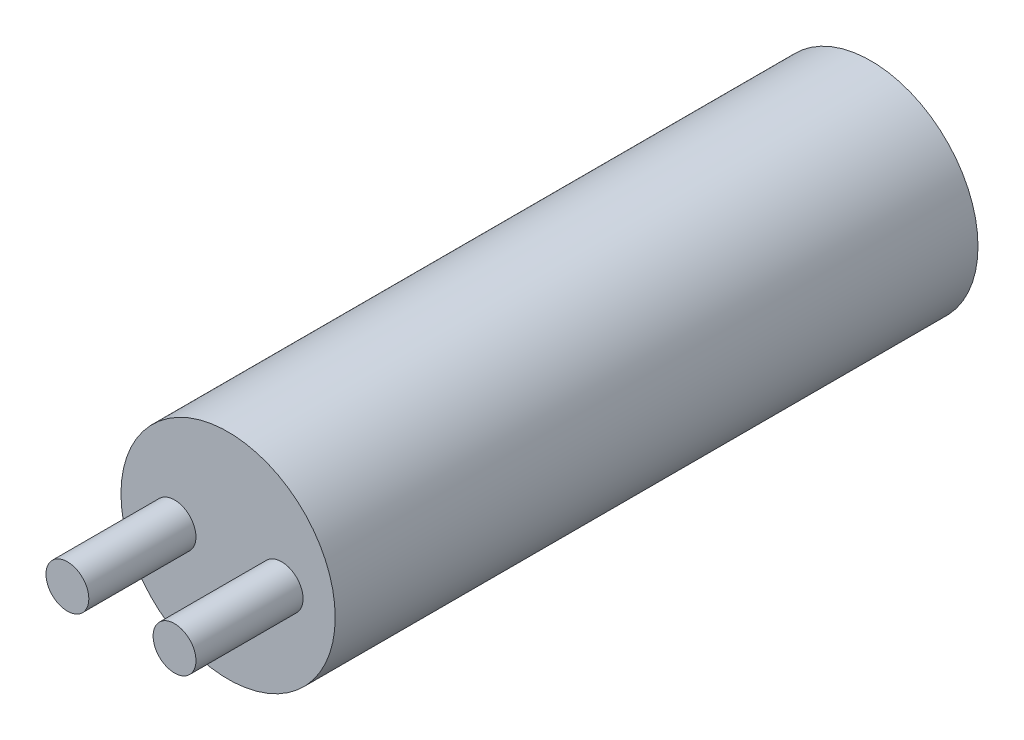
ISO-10303-21;
HEADER;
FILE_DESCRIPTION(('STEP AP214'),'2;1');
FILE_NAME('part.step','',(''),(''),'','','');
FILE_SCHEMA(('AUTOMOTIVE_DESIGN { 1 0 10303 214 1 1 1 1 }'));
ENDSEC;
DATA;
#1=APPLICATION_CONTEXT('core data for automotive mechanical design processes');
#2=APPLICATION_PROTOCOL_DEFINITION('international standard','automotive_design',2000,#1);
#3=PRODUCT_CONTEXT('',#1,'mechanical');
#4=PRODUCT('Part','Part','',(#3));
#5=PRODUCT_RELATED_PRODUCT_CATEGORY('part','',(#4));
#6=PRODUCT_DEFINITION_FORMATION('','',#4);
#7=PRODUCT_DEFINITION_CONTEXT('part definition',#1,'design');
#8=PRODUCT_DEFINITION('design','',#6,#7);
#9=PRODUCT_DEFINITION_SHAPE('','',#8);
#10=(LENGTH_UNIT() NAMED_UNIT(*) SI_UNIT(.MILLI.,.METRE.));
#11=(NAMED_UNIT(*) PLANE_ANGLE_UNIT() SI_UNIT($,.RADIAN.));
#12=(NAMED_UNIT(*) SI_UNIT($,.STERADIAN.) SOLID_ANGLE_UNIT());
#13=UNCERTAINTY_MEASURE_WITH_UNIT(LENGTH_MEASURE(1.E-05),#10,'distance_accuracy_value','');
#14=(GEOMETRIC_REPRESENTATION_CONTEXT(3) GLOBAL_UNCERTAINTY_ASSIGNED_CONTEXT((#13)) GLOBAL_UNIT_ASSIGNED_CONTEXT((#10,
#11,#12)) REPRESENTATION_CONTEXT('',''));
#15=CARTESIAN_POINT('',(0.,0.,0.));
#16=DIRECTION('',(0.,0.,1.));
#17=DIRECTION('',(1.,0.,0.));
#18=AXIS2_PLACEMENT_3D('',#15,#16,#17);
#19=CARTESIAN_POINT('',(0.,0.,101.6));
#20=DIRECTION('',(0.,0.,-1.));
#21=DIRECTION('',(-1.,0.,0.));
#22=AXIS2_PLACEMENT_3D('',#19,#20,#21);
#23=CYLINDRICAL_SURFACE('',#22,12.7);
#24=CARTESIAN_POINT('',(0.,0.,101.6));
#25=DIRECTION('',(0.,0.,1.));
#26=DIRECTION('',(1.,0.,0.));
#27=AXIS2_PLACEMENT_3D('',#24,#25,#26);
#28=CIRCLE('',#27,12.7);
#29=CARTESIAN_POINT('',(12.7,0.,101.6));
#30=VERTEX_POINT('',#29);
#31=EDGE_CURVE('E10',#30,#30,#28,.T.);
#32=ORIENTED_EDGE('',*,*,#31,.F.);
#33=EDGE_LOOP('',(#32));
#34=FACE_BOUND('',#33,.T.);
#35=CARTESIAN_POINT('',(0.,0.,25.4));
#36=DIRECTION('',(0.,0.,-1.));
#37=DIRECTION('',(-1.,0.,0.));
#38=AXIS2_PLACEMENT_3D('',#35,#36,#37);
#39=CIRCLE('',#38,12.7);
#40=CARTESIAN_POINT('',(-12.7,0.,25.4));
#41=VERTEX_POINT('',#40);
#42=EDGE_CURVE('E39',#41,#41,#39,.T.);
#43=ORIENTED_EDGE('',*,*,#42,.F.);
#44=EDGE_LOOP('',(#43));
#45=FACE_BOUND('',#44,.T.);
#46=ADVANCED_FACE('F36',(#34,#45),#23,.T.);
#47=CARTESIAN_POINT('',(0.,0.,101.6));
#48=DIRECTION('',(0.,0.,1.));
#49=DIRECTION('',(1.,0.,0.));
#50=AXIS2_PLACEMENT_3D('',#47,#48,#49);
#51=PLANE('',#50);
#52=CARTESIAN_POINT('',(6.35,0.,101.6));
#53=DIRECTION('',(0.,0.,1.));
#54=DIRECTION('',(1.,0.,0.));
#55=AXIS2_PLACEMENT_3D('',#52,#53,#54);
#56=CIRCLE('',#55,2.54);
#57=CARTESIAN_POINT('',(8.89,0.,101.6));
#58=VERTEX_POINT('',#57);
#59=EDGE_CURVE('E53',#58,#58,#56,.T.);
#60=ORIENTED_EDGE('',*,*,#59,.F.);
#61=EDGE_LOOP('',(#60));
#62=FACE_BOUND('',#61,.T.);
#63=CARTESIAN_POINT('',(-6.35,0.,101.6));
#64=DIRECTION('',(0.,0.,1.));
#65=DIRECTION('',(1.,0.,0.));
#66=AXIS2_PLACEMENT_3D('',#63,#64,#65);
#67=CIRCLE('',#66,2.54);
#68=CARTESIAN_POINT('',(-3.81,0.,101.6));
#69=VERTEX_POINT('',#68);
#70=EDGE_CURVE('E47',#69,#69,#67,.T.);
#71=ORIENTED_EDGE('',*,*,#70,.F.);
#72=EDGE_LOOP('',(#71));
#73=FACE_BOUND('',#72,.T.);
#74=ORIENTED_EDGE('',*,*,#31,.T.);
#75=EDGE_LOOP('',(#74));
#76=FACE_BOUND('',#75,.T.);
#77=ADVANCED_FACE('F68',(#62,#73,#76),#51,.T.);
#78=CARTESIAN_POINT('',(-6.35,0.,114.3));
#79=DIRECTION('',(0.,0.,-1.));
#80=DIRECTION('',(-1.,0.,0.));
#81=AXIS2_PLACEMENT_3D('',#78,#79,#80);
#82=CYLINDRICAL_SURFACE('',#81,2.54);
#83=CARTESIAN_POINT('',(-6.35,0.,114.3));
#84=DIRECTION('',(0.,0.,1.));
#85=DIRECTION('',(1.,0.,0.));
#86=AXIS2_PLACEMENT_3D('',#83,#84,#85);
#87=CIRCLE('',#86,2.54);
#88=CARTESIAN_POINT('',(-3.81,0.,114.3));
#89=VERTEX_POINT('',#88);
#90=EDGE_CURVE('E43',#89,#89,#87,.T.);
#91=ORIENTED_EDGE('',*,*,#90,.F.);
#92=EDGE_LOOP('',(#91));
#93=FACE_BOUND('',#92,.T.);
#94=ORIENTED_EDGE('',*,*,#70,.T.);
#95=EDGE_LOOP('',(#94));
#96=FACE_BOUND('',#95,.T.);
#97=ADVANCED_FACE('F71',(#93,#96),#82,.T.);
#98=CARTESIAN_POINT('',(0.,0.,114.3));
#99=DIRECTION('',(0.,0.,1.));
#100=DIRECTION('',(1.,0.,0.));
#101=AXIS2_PLACEMENT_3D('',#98,#99,#100);
#102=PLANE('',#101);
#103=ORIENTED_EDGE('',*,*,#90,.T.);
#104=EDGE_LOOP('',(#103));
#105=FACE_BOUND('',#104,.T.);
#106=ADVANCED_FACE('F64',(#105),#102,.T.);
#107=CARTESIAN_POINT('',(6.35,0.,114.3));
#108=DIRECTION('',(0.,0.,-1.));
#109=DIRECTION('',(-1.,0.,0.));
#110=AXIS2_PLACEMENT_3D('',#107,#108,#109);
#111=CYLINDRICAL_SURFACE('',#110,2.54);
#112=CARTESIAN_POINT('',(6.35,0.,114.3));
#113=DIRECTION('',(0.,0.,1.));
#114=DIRECTION('',(1.,0.,0.));
#115=AXIS2_PLACEMENT_3D('',#112,#113,#114);
#116=CIRCLE('',#115,2.54);
#117=CARTESIAN_POINT('',(8.89,0.,114.3));
#118=VERTEX_POINT('',#117);
#119=EDGE_CURVE('E51',#118,#118,#116,.T.);
#120=ORIENTED_EDGE('',*,*,#119,.F.);
#121=EDGE_LOOP('',(#120));
#122=FACE_BOUND('',#121,.T.);
#123=ORIENTED_EDGE('',*,*,#59,.T.);
#124=EDGE_LOOP('',(#123));
#125=FACE_BOUND('',#124,.T.);
#126=ADVANCED_FACE('F61',(#122,#125),#111,.T.);
#127=CARTESIAN_POINT('',(0.,0.,114.3));
#128=DIRECTION('',(0.,0.,1.));
#129=DIRECTION('',(1.,0.,0.));
#130=AXIS2_PLACEMENT_3D('',#127,#128,#129);
#131=PLANE('',#130);
#132=ORIENTED_EDGE('',*,*,#119,.T.);
#133=EDGE_LOOP('',(#132));
#134=FACE_BOUND('',#133,.T.);
#135=ADVANCED_FACE('F59',(#134),#131,.T.);
#136=CARTESIAN_POINT('',(0.,0.,25.4));
#137=DIRECTION('',(0.,0.,-1.));
#138=DIRECTION('',(-1.,0.,0.));
#139=AXIS2_PLACEMENT_3D('',#136,#137,#138);
#140=PLANE('',#139);
#141=ORIENTED_EDGE('',*,*,#42,.T.);
#142=EDGE_LOOP('',(#141));
#143=FACE_BOUND('',#142,.T.);
#144=ADVANCED_FACE('F91',(#143),#140,.T.);
#145=CLOSED_SHELL('',(#46,#77,#97,#106,#126,#135,#144));
#146=MANIFOLD_SOLID_BREP('B2',#145);
#147=ADVANCED_BREP_SHAPE_REPRESENTATION('',(#18,#146),#14);
#148=SHAPE_DEFINITION_REPRESENTATION(#9,#147);
ENDSEC;
END-ISO-10303-21;
